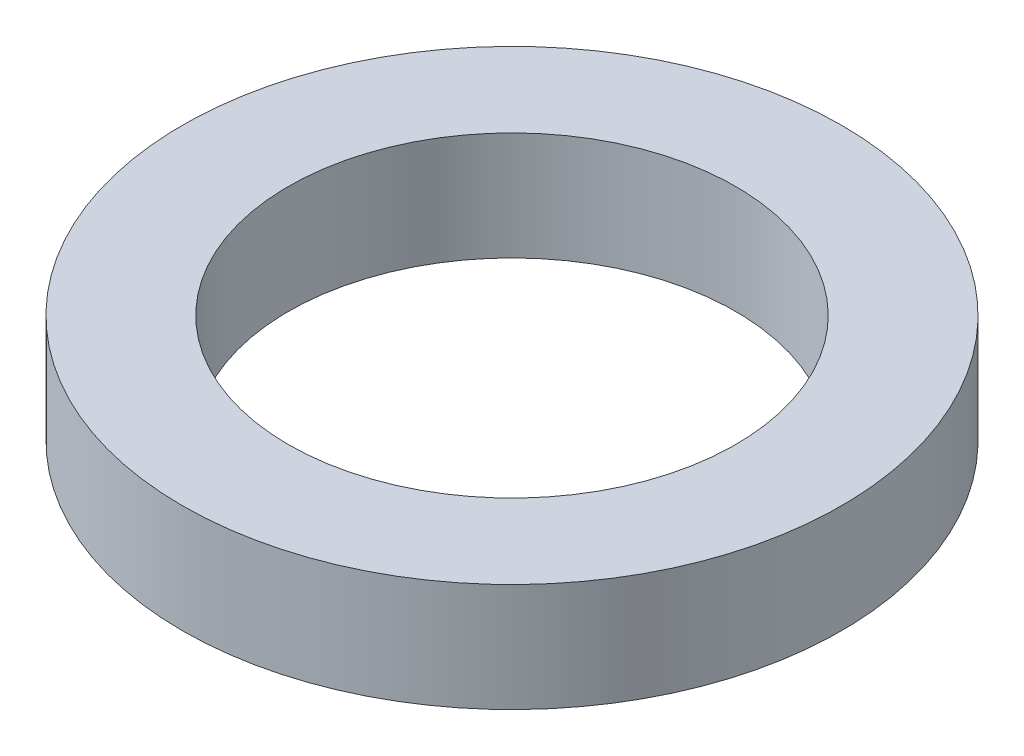
ISO-10303-21;
HEADER;
FILE_DESCRIPTION(('STEP AP214'),'2;1');
FILE_NAME('part.step','',(''),(''),'','','');
FILE_SCHEMA(('AUTOMOTIVE_DESIGN { 1 0 10303 214 1 1 1 1 }'));
ENDSEC;
DATA;
#1=APPLICATION_CONTEXT('core data for automotive mechanical design processes');
#2=APPLICATION_PROTOCOL_DEFINITION('international standard','automotive_design',2000,#1);
#3=PRODUCT_CONTEXT('',#1,'mechanical');
#4=PRODUCT('Part','Part','',(#3));
#5=PRODUCT_RELATED_PRODUCT_CATEGORY('part','',(#4));
#6=PRODUCT_DEFINITION_FORMATION('','',#4);
#7=PRODUCT_DEFINITION_CONTEXT('part definition',#1,'design');
#8=PRODUCT_DEFINITION('design','',#6,#7);
#9=PRODUCT_DEFINITION_SHAPE('','',#8);
#10=(LENGTH_UNIT() NAMED_UNIT(*) SI_UNIT(.MILLI.,.METRE.));
#11=(NAMED_UNIT(*) PLANE_ANGLE_UNIT() SI_UNIT($,.RADIAN.));
#12=(NAMED_UNIT(*) SI_UNIT($,.STERADIAN.) SOLID_ANGLE_UNIT());
#13=UNCERTAINTY_MEASURE_WITH_UNIT(LENGTH_MEASURE(1.E-05),#10,'distance_accuracy_value','');
#14=(GEOMETRIC_REPRESENTATION_CONTEXT(3) GLOBAL_UNCERTAINTY_ASSIGNED_CONTEXT((#13)) GLOBAL_UNIT_ASSIGNED_CONTEXT((#10,
#11,#12)) REPRESENTATION_CONTEXT('',''));
#15=CARTESIAN_POINT('',(0.,0.,0.));
#16=DIRECTION('',(0.,0.,1.));
#17=DIRECTION('',(1.,0.,0.));
#18=AXIS2_PLACEMENT_3D('',#15,#16,#17);
#19=CARTESIAN_POINT('',(0.,23.,0.));
#20=DIRECTION('',(0.,-1.,0.));
#21=DIRECTION('',(0.,0.,-1.));
#22=AXIS2_PLACEMENT_3D('',#19,#20,#21);
#23=CYLINDRICAL_SURFACE('',#22,70.);
#24=CARTESIAN_POINT('',(0.,23.,0.));
#25=DIRECTION('',(0.,1.,0.));
#26=DIRECTION('',(0.,0.,1.));
#27=AXIS2_PLACEMENT_3D('',#24,#25,#26);
#28=CIRCLE('',#27,70.);
#29=CARTESIAN_POINT('',(0.,23.,70.));
#30=VERTEX_POINT('',#29);
#31=EDGE_CURVE('E10',#30,#30,#28,.T.);
#32=ORIENTED_EDGE('',*,*,#31,.F.);
#33=EDGE_LOOP('',(#32));
#34=FACE_BOUND('',#33,.T.);
#35=CARTESIAN_POINT('',(0.,0.,0.));
#36=DIRECTION('',(0.,1.,0.));
#37=DIRECTION('',(0.,0.,1.));
#38=AXIS2_PLACEMENT_3D('',#35,#36,#37);
#39=CIRCLE('',#38,70.);
#40=CARTESIAN_POINT('',(0.,0.,70.));
#41=VERTEX_POINT('',#40);
#42=EDGE_CURVE('E37',#41,#41,#39,.T.);
#43=ORIENTED_EDGE('',*,*,#42,.T.);
#44=EDGE_LOOP('',(#43));
#45=FACE_BOUND('',#44,.T.);
#46=ADVANCED_FACE('F40',(#34,#45),#23,.T.);
#47=CARTESIAN_POINT('',(0.,23.,0.));
#48=DIRECTION('',(0.,1.,0.));
#49=DIRECTION('',(0.,0.,1.));
#50=AXIS2_PLACEMENT_3D('',#47,#48,#49);
#51=PLANE('',#50);
#52=CARTESIAN_POINT('',(0.,23.,0.));
#53=DIRECTION('',(0.,1.,0.));
#54=DIRECTION('',(0.,0.,1.));
#55=AXIS2_PLACEMENT_3D('',#52,#53,#54);
#56=CIRCLE('',#55,47.5);
#57=CARTESIAN_POINT('',(0.,23.,47.5));
#58=VERTEX_POINT('',#57);
#59=EDGE_CURVE('E50',#58,#58,#56,.T.);
#60=ORIENTED_EDGE('',*,*,#59,.F.);
#61=EDGE_LOOP('',(#60));
#62=FACE_BOUND('',#61,.T.);
#63=ORIENTED_EDGE('',*,*,#31,.T.);
#64=EDGE_LOOP('',(#63));
#65=FACE_BOUND('',#64,.T.);
#66=ADVANCED_FACE('F59',(#62,#65),#51,.T.);
#67=CARTESIAN_POINT('',(0.,0.,0.));
#68=DIRECTION('',(0.,1.,0.));
#69=DIRECTION('',(0.,0.,1.));
#70=AXIS2_PLACEMENT_3D('',#67,#68,#69);
#71=PLANE('',#70);
#72=CARTESIAN_POINT('',(0.,0.,0.));
#73=DIRECTION('',(0.,1.,0.));
#74=DIRECTION('',(0.,0.,1.));
#75=AXIS2_PLACEMENT_3D('',#72,#73,#74);
#76=CIRCLE('',#75,47.5);
#77=CARTESIAN_POINT('',(0.,0.,47.5));
#78=VERTEX_POINT('',#77);
#79=EDGE_CURVE('E47',#78,#78,#76,.T.);
#80=ORIENTED_EDGE('',*,*,#79,.T.);
#81=EDGE_LOOP('',(#80));
#82=FACE_BOUND('',#81,.T.);
#83=ORIENTED_EDGE('',*,*,#42,.F.);
#84=EDGE_LOOP('',(#83));
#85=FACE_BOUND('',#84,.T.);
#86=ADVANCED_FACE('F58',(#82,#85),#71,.F.);
#87=CARTESIAN_POINT('',(0.,23.,0.));
#88=DIRECTION('',(0.,-1.,0.));
#89=DIRECTION('',(0.,0.,-1.));
#90=AXIS2_PLACEMENT_3D('',#87,#88,#89);
#91=CYLINDRICAL_SURFACE('',#90,47.5);
#92=ORIENTED_EDGE('',*,*,#59,.T.);
#93=EDGE_LOOP('',(#92));
#94=FACE_BOUND('',#93,.T.);
#95=ORIENTED_EDGE('',*,*,#79,.F.);
#96=EDGE_LOOP('',(#95));
#97=FACE_BOUND('',#96,.T.);
#98=ADVANCED_FACE('F54',(#94,#97),#91,.F.);
#99=CLOSED_SHELL('',(#46,#66,#86,#98));
#100=MANIFOLD_SOLID_BREP('B2',#99);
#101=ADVANCED_BREP_SHAPE_REPRESENTATION('',(#18,#100),#14);
#102=SHAPE_DEFINITION_REPRESENTATION(#9,#101);
ENDSEC;
END-ISO-10303-21;
